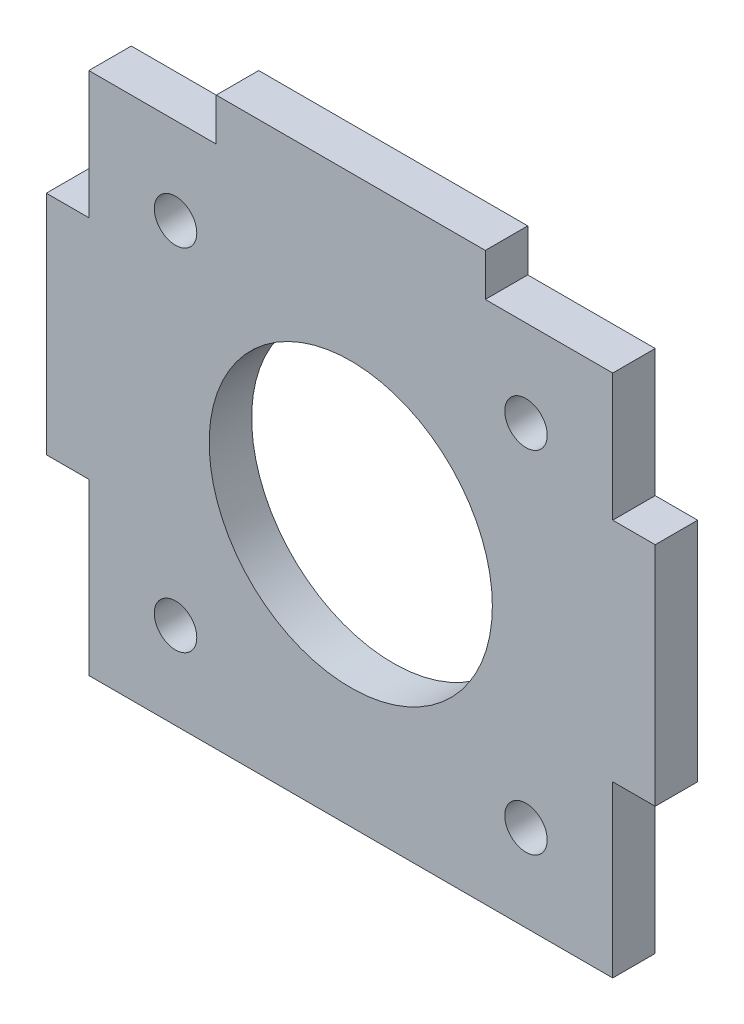
ISO-10303-21;
HEADER;
FILE_DESCRIPTION(('STEP AP214'),'2;1');
FILE_NAME('part.step','',(''),(''),'','','');
FILE_SCHEMA(('AUTOMOTIVE_DESIGN { 1 0 10303 214 1 1 1 1 }'));
ENDSEC;
DATA;
#1=APPLICATION_CONTEXT('core data for automotive mechanical design processes');
#2=APPLICATION_PROTOCOL_DEFINITION('international standard','automotive_design',2000,#1);
#3=PRODUCT_CONTEXT('',#1,'mechanical');
#4=PRODUCT('Part','Part','',(#3));
#5=PRODUCT_RELATED_PRODUCT_CATEGORY('part','',(#4));
#6=PRODUCT_DEFINITION_FORMATION('','',#4);
#7=PRODUCT_DEFINITION_CONTEXT('part definition',#1,'design');
#8=PRODUCT_DEFINITION('design','',#6,#7);
#9=PRODUCT_DEFINITION_SHAPE('','',#8);
#10=(LENGTH_UNIT() NAMED_UNIT(*) SI_UNIT(.MILLI.,.METRE.));
#11=(NAMED_UNIT(*) PLANE_ANGLE_UNIT() SI_UNIT($,.RADIAN.));
#12=(NAMED_UNIT(*) SI_UNIT($,.STERADIAN.) SOLID_ANGLE_UNIT());
#13=UNCERTAINTY_MEASURE_WITH_UNIT(LENGTH_MEASURE(1.E-05),#10,'distance_accuracy_value','');
#14=(GEOMETRIC_REPRESENTATION_CONTEXT(3) GLOBAL_UNCERTAINTY_ASSIGNED_CONTEXT((#13)) GLOBAL_UNIT_ASSIGNED_CONTEXT((#10,
#11,#12)) REPRESENTATION_CONTEXT('',''));
#15=CARTESIAN_POINT('',(0.,0.,0.));
#16=DIRECTION('',(0.,0.,1.));
#17=DIRECTION('',(1.,0.,0.));
#18=AXIS2_PLACEMENT_3D('',#15,#16,#17);
#19=CARTESIAN_POINT('',(0.,0.,3.));
#20=DIRECTION('',(0.,0.,1.));
#21=DIRECTION('',(1.,0.,0.));
#22=AXIS2_PLACEMENT_3D('',#19,#20,#21);
#23=PLANE('',#22);
#24=DIRECTION('',(-1.,0.,0.));
#25=VECTOR('',#24,1.);
#26=CARTESIAN_POINT('',(-21.5,-6.5,3.));
#27=LINE('',#26,#25);
#28=CARTESIAN_POINT('',(-18.5,-6.5,3.));
#29=VERTEX_POINT('',#28);
#30=CARTESIAN_POINT('',(-21.5,-6.5,3.));
#31=VERTEX_POINT('',#30);
#32=EDGE_CURVE('E62',#29,#31,#27,.T.);
#33=ORIENTED_EDGE('',*,*,#32,.F.);
#34=DIRECTION('',(0.,1.,0.));
#35=VECTOR('',#34,1.);
#36=CARTESIAN_POINT('',(-18.5,-18.5,3.));
#37=LINE('',#36,#35);
#38=CARTESIAN_POINT('',(-18.5,-18.5,3.));
#39=VERTEX_POINT('',#38);
#40=EDGE_CURVE('E290',#39,#29,#37,.T.);
#41=ORIENTED_EDGE('',*,*,#40,.F.);
#42=DIRECTION('',(-1.,0.,0.));
#43=VECTOR('',#42,1.);
#44=CARTESIAN_POINT('',(-18.5,-18.5,3.));
#45=LINE('',#44,#43);
#46=CARTESIAN_POINT('',(18.5,-18.5,3.));
#47=VERTEX_POINT('',#46);
#48=EDGE_CURVE('E293',#47,#39,#45,.T.);
#49=ORIENTED_EDGE('',*,*,#48,.F.);
#50=DIRECTION('',(0.,-1.,0.));
#51=VECTOR('',#50,1.);
#52=CARTESIAN_POINT('',(18.5,-18.5,3.));
#53=LINE('',#52,#51);
#54=CARTESIAN_POINT('',(18.5,-6.5,3.));
#55=VERTEX_POINT('',#54);
#56=EDGE_CURVE('E296',#55,#47,#53,.T.);
#57=ORIENTED_EDGE('',*,*,#56,.F.);
#58=DIRECTION('',(-1.,0.,0.));
#59=VECTOR('',#58,1.);
#60=CARTESIAN_POINT('',(21.5,-6.5,3.));
#61=LINE('',#60,#59);
#62=CARTESIAN_POINT('',(21.5,-6.5,3.));
#63=VERTEX_POINT('',#62);
#64=EDGE_CURVE('E259',#63,#55,#61,.T.);
#65=ORIENTED_EDGE('',*,*,#64,.F.);
#66=DIRECTION('',(0.,1.,0.));
#67=VECTOR('',#66,1.);
#68=CARTESIAN_POINT('',(21.5,21.5,3.));
#69=LINE('',#68,#67);
#70=CARTESIAN_POINT('',(21.5,9.5,3.));
#71=VERTEX_POINT('',#70);
#72=EDGE_CURVE('E170',#63,#71,#69,.T.);
#73=ORIENTED_EDGE('',*,*,#72,.T.);
#74=DIRECTION('',(1.,0.,0.));
#75=VECTOR('',#74,1.);
#76=CARTESIAN_POINT('',(21.5,9.5,3.));
#77=LINE('',#76,#75);
#78=CARTESIAN_POINT('',(18.5,9.5,3.));
#79=VERTEX_POINT('',#78);
#80=EDGE_CURVE('E239',#79,#71,#77,.T.);
#81=ORIENTED_EDGE('',*,*,#80,.F.);
#82=DIRECTION('',(0.,-1.,0.));
#83=VECTOR('',#82,1.);
#84=CARTESIAN_POINT('',(18.5,9.5,3.));
#85=LINE('',#84,#83);
#86=CARTESIAN_POINT('',(18.5,18.5,3.));
#87=VERTEX_POINT('',#86);
#88=EDGE_CURVE('E230',#87,#79,#85,.T.);
#89=ORIENTED_EDGE('',*,*,#88,.F.);
#90=DIRECTION('',(1.,0.,0.));
#91=VECTOR('',#90,1.);
#92=CARTESIAN_POINT('',(18.5,18.5,3.));
#93=LINE('',#92,#91);
#94=CARTESIAN_POINT('',(9.49999999999999,18.5,3.));
#95=VERTEX_POINT('',#94);
#96=EDGE_CURVE('E233',#95,#87,#93,.T.);
#97=ORIENTED_EDGE('',*,*,#96,.F.);
#98=DIRECTION('',(0.,-1.,0.));
#99=VECTOR('',#98,1.);
#100=CARTESIAN_POINT('',(9.49999999999999,18.5,3.));
#101=LINE('',#100,#99);
#102=CARTESIAN_POINT('',(9.49999999999999,21.5,3.));
#103=VERTEX_POINT('',#102);
#104=EDGE_CURVE('E236',#103,#95,#101,.T.);
#105=ORIENTED_EDGE('',*,*,#104,.F.);
#106=DIRECTION('',(-1.,0.,0.));
#107=VECTOR('',#106,1.);
#108=CARTESIAN_POINT('',(-21.5,21.5,3.));
#109=LINE('',#108,#107);
#110=CARTESIAN_POINT('',(-9.5,21.5,3.));
#111=VERTEX_POINT('',#110);
#112=EDGE_CURVE('E46',#103,#111,#109,.T.);
#113=ORIENTED_EDGE('',*,*,#112,.T.);
#114=DIRECTION('',(0.,1.,0.));
#115=VECTOR('',#114,1.);
#116=CARTESIAN_POINT('',(-9.5,18.5,3.));
#117=LINE('',#116,#115);
#118=CARTESIAN_POINT('',(-9.5,18.5,3.));
#119=VERTEX_POINT('',#118);
#120=EDGE_CURVE('E260',#119,#111,#117,.T.);
#121=ORIENTED_EDGE('',*,*,#120,.F.);
#122=DIRECTION('',(1.,0.,0.));
#123=VECTOR('',#122,1.);
#124=CARTESIAN_POINT('',(-18.5,18.5,3.));
#125=LINE('',#124,#123);
#126=CARTESIAN_POINT('',(-18.5,18.5,3.));
#127=VERTEX_POINT('',#126);
#128=EDGE_CURVE('E263',#127,#119,#125,.T.);
#129=ORIENTED_EDGE('',*,*,#128,.F.);
#130=DIRECTION('',(0.,1.,0.));
#131=VECTOR('',#130,1.);
#132=CARTESIAN_POINT('',(-18.5,9.49999999999999,3.));
#133=LINE('',#132,#131);
#134=CARTESIAN_POINT('',(-18.5,9.49999999999999,3.));
#135=VERTEX_POINT('',#134);
#136=EDGE_CURVE('E266',#135,#127,#133,.T.);
#137=ORIENTED_EDGE('',*,*,#136,.F.);
#138=DIRECTION('',(1.,0.,0.));
#139=VECTOR('',#138,1.);
#140=CARTESIAN_POINT('',(-21.5,9.49999999999999,3.));
#141=LINE('',#140,#139);
#142=CARTESIAN_POINT('',(-21.5,9.49999999999999,3.));
#143=VERTEX_POINT('',#142);
#144=EDGE_CURVE('E229',#143,#135,#141,.T.);
#145=ORIENTED_EDGE('',*,*,#144,.F.);
#146=DIRECTION('',(0.,-1.,0.));
#147=VECTOR('',#146,1.);
#148=CARTESIAN_POINT('',(-21.5,21.5,3.));
#149=LINE('',#148,#147);
#150=EDGE_CURVE('E11',#143,#31,#149,.T.);
#151=ORIENTED_EDGE('',*,*,#150,.T.);
#152=EDGE_LOOP('',(#33,#41,#49,#57,#65,#73,#81,#89,#97,#105,#113,#121,#129,#137,#145,#151));
#153=FACE_BOUND('',#152,.T.);
#154=CARTESIAN_POINT('',(-12.3743686707647,-12.3743686707645,3.));
#155=DIRECTION('',(0.,0.,1.));
#156=DIRECTION('',(1.,0.,0.));
#157=AXIS2_PLACEMENT_3D('',#154,#155,#156);
#158=CIRCLE('',#157,1.5);
#159=CARTESIAN_POINT('',(-10.8743686707647,-12.3743686707645,3.));
#160=VERTEX_POINT('',#159);
#161=EDGE_CURVE('E203',#160,#160,#158,.T.);
#162=ORIENTED_EDGE('',*,*,#161,.F.);
#163=EDGE_LOOP('',(#162));
#164=FACE_BOUND('',#163,.T.);
#165=CARTESIAN_POINT('',(12.3743686707645,-12.3743686707646,3.));
#166=DIRECTION('',(0.,0.,1.));
#167=DIRECTION('',(1.,0.,0.));
#168=AXIS2_PLACEMENT_3D('',#165,#166,#167);
#169=CIRCLE('',#168,1.5);
#170=CARTESIAN_POINT('',(13.8743686707645,-12.3743686707646,3.));
#171=VERTEX_POINT('',#170);
#172=EDGE_CURVE('E192',#171,#171,#169,.T.);
#173=ORIENTED_EDGE('',*,*,#172,.F.);
#174=EDGE_LOOP('',(#173));
#175=FACE_BOUND('',#174,.T.);
#176=CARTESIAN_POINT('',(-12.3743686707645,12.3743686707647,3.));
#177=DIRECTION('',(0.,0.,1.));
#178=DIRECTION('',(1.,0.,0.));
#179=AXIS2_PLACEMENT_3D('',#176,#177,#178);
#180=CIRCLE('',#179,1.5);
#181=CARTESIAN_POINT('',(-10.8743686707645,12.3743686707647,3.));
#182=VERTEX_POINT('',#181);
#183=EDGE_CURVE('E181',#182,#182,#180,.T.);
#184=ORIENTED_EDGE('',*,*,#183,.F.);
#185=EDGE_LOOP('',(#184));
#186=FACE_BOUND('',#185,.T.);
#187=CARTESIAN_POINT('',(12.3743686707646,12.3743686707645,3.));
#188=DIRECTION('',(0.,0.,1.));
#189=DIRECTION('',(1.,0.,0.));
#190=AXIS2_PLACEMENT_3D('',#187,#188,#189);
#191=CIRCLE('',#190,1.5);
#192=CARTESIAN_POINT('',(13.8743686707646,12.3743686707645,3.));
#193=VERTEX_POINT('',#192);
#194=EDGE_CURVE('E197',#193,#193,#191,.T.);
#195=ORIENTED_EDGE('',*,*,#194,.F.);
#196=EDGE_LOOP('',(#195));
#197=FACE_BOUND('',#196,.T.);
#198=CARTESIAN_POINT('',(0.,0.,3.));
#199=DIRECTION('',(0.,0.,1.));
#200=DIRECTION('',(1.,0.,0.));
#201=AXIS2_PLACEMENT_3D('',#198,#199,#200);
#202=CIRCLE('',#201,10.);
#203=CARTESIAN_POINT('',(9.99999999999999,0.,3.));
#204=VERTEX_POINT('',#203);
#205=EDGE_CURVE('E209',#204,#204,#202,.T.);
#206=ORIENTED_EDGE('',*,*,#205,.F.);
#207=EDGE_LOOP('',(#206));
#208=FACE_BOUND('',#207,.T.);
#209=ADVANCED_FACE('F37',(#153,#164,#175,#186,#197,#208),#23,.T.);
#210=CARTESIAN_POINT('',(0.,0.,0.));
#211=DIRECTION('',(0.,0.,1.));
#212=DIRECTION('',(1.,0.,0.));
#213=AXIS2_PLACEMENT_3D('',#210,#211,#212);
#214=PLANE('',#213);
#215=DIRECTION('',(0.,1.,0.));
#216=VECTOR('',#215,1.);
#217=CARTESIAN_POINT('',(-18.5,-18.5,0.));
#218=LINE('',#217,#216);
#219=CARTESIAN_POINT('',(-18.5,-18.5,0.));
#220=VERTEX_POINT('',#219);
#221=CARTESIAN_POINT('',(-18.5,-6.5,0.));
#222=VERTEX_POINT('',#221);
#223=EDGE_CURVE('E302',#220,#222,#218,.T.);
#224=ORIENTED_EDGE('',*,*,#223,.T.);
#225=DIRECTION('',(-1.,0.,0.));
#226=VECTOR('',#225,1.);
#227=CARTESIAN_POINT('',(-21.5,-6.5,0.));
#228=LINE('',#227,#226);
#229=CARTESIAN_POINT('',(-21.5,-6.5,0.));
#230=VERTEX_POINT('',#229);
#231=EDGE_CURVE('E171',#222,#230,#228,.T.);
#232=ORIENTED_EDGE('',*,*,#231,.T.);
#233=DIRECTION('',(0.,-1.,0.));
#234=VECTOR('',#233,1.);
#235=CARTESIAN_POINT('',(-21.5,21.5,0.));
#236=LINE('',#235,#234);
#237=CARTESIAN_POINT('',(-21.5,9.49999999999999,0.));
#238=VERTEX_POINT('',#237);
#239=EDGE_CURVE('E41',#238,#230,#236,.T.);
#240=ORIENTED_EDGE('',*,*,#239,.F.);
#241=DIRECTION('',(1.,0.,0.));
#242=VECTOR('',#241,1.);
#243=CARTESIAN_POINT('',(-21.5,9.49999999999999,0.));
#244=LINE('',#243,#242);
#245=CARTESIAN_POINT('',(-18.5,9.49999999999999,0.));
#246=VERTEX_POINT('',#245);
#247=EDGE_CURVE('E262',#238,#246,#244,.T.);
#248=ORIENTED_EDGE('',*,*,#247,.T.);
#249=DIRECTION('',(0.,1.,0.));
#250=VECTOR('',#249,1.);
#251=CARTESIAN_POINT('',(-18.5,9.49999999999999,0.));
#252=LINE('',#251,#250);
#253=CARTESIAN_POINT('',(-18.5,18.5,0.));
#254=VERTEX_POINT('',#253);
#255=EDGE_CURVE('E276',#246,#254,#252,.T.);
#256=ORIENTED_EDGE('',*,*,#255,.T.);
#257=DIRECTION('',(1.,0.,0.));
#258=VECTOR('',#257,1.);
#259=CARTESIAN_POINT('',(-18.5,18.5,0.));
#260=LINE('',#259,#258);
#261=CARTESIAN_POINT('',(-9.5,18.5,0.));
#262=VERTEX_POINT('',#261);
#263=EDGE_CURVE('E273',#254,#262,#260,.T.);
#264=ORIENTED_EDGE('',*,*,#263,.T.);
#265=DIRECTION('',(0.,1.,0.));
#266=VECTOR('',#265,1.);
#267=CARTESIAN_POINT('',(-9.5,18.5,0.));
#268=LINE('',#267,#266);
#269=CARTESIAN_POINT('',(-9.5,21.5,0.));
#270=VERTEX_POINT('',#269);
#271=EDGE_CURVE('E250',#262,#270,#268,.T.);
#272=ORIENTED_EDGE('',*,*,#271,.T.);
#273=DIRECTION('',(-1.,0.,0.));
#274=VECTOR('',#273,1.);
#275=CARTESIAN_POINT('',(-21.5,21.5,0.));
#276=LINE('',#275,#274);
#277=CARTESIAN_POINT('',(9.49999999999999,21.5,0.));
#278=VERTEX_POINT('',#277);
#279=EDGE_CURVE('E180',#278,#270,#276,.T.);
#280=ORIENTED_EDGE('',*,*,#279,.F.);
#281=DIRECTION('',(0.,-1.,0.));
#282=VECTOR('',#281,1.);
#283=CARTESIAN_POINT('',(9.49999999999999,18.5,0.));
#284=LINE('',#283,#282);
#285=CARTESIAN_POINT('',(9.49999999999999,18.5,0.));
#286=VERTEX_POINT('',#285);
#287=EDGE_CURVE('E54',#278,#286,#284,.T.);
#288=ORIENTED_EDGE('',*,*,#287,.T.);
#289=DIRECTION('',(1.,0.,0.));
#290=VECTOR('',#289,1.);
#291=CARTESIAN_POINT('',(18.5,18.5,0.));
#292=LINE('',#291,#290);
#293=CARTESIAN_POINT('',(18.5,18.5,0.));
#294=VERTEX_POINT('',#293);
#295=EDGE_CURVE('E242',#286,#294,#292,.T.);
#296=ORIENTED_EDGE('',*,*,#295,.T.);
#297=DIRECTION('',(0.,-1.,0.));
#298=VECTOR('',#297,1.);
#299=CARTESIAN_POINT('',(18.5,9.5,0.));
#300=LINE('',#299,#298);
#301=CARTESIAN_POINT('',(18.5,9.5,0.));
#302=VERTEX_POINT('',#301);
#303=EDGE_CURVE('E221',#294,#302,#300,.T.);
#304=ORIENTED_EDGE('',*,*,#303,.T.);
#305=DIRECTION('',(1.,0.,0.));
#306=VECTOR('',#305,1.);
#307=CARTESIAN_POINT('',(21.5,9.5,0.));
#308=LINE('',#307,#306);
#309=CARTESIAN_POINT('',(21.5,9.5,0.));
#310=VERTEX_POINT('',#309);
#311=EDGE_CURVE('E179',#302,#310,#308,.T.);
#312=ORIENTED_EDGE('',*,*,#311,.T.);
#313=DIRECTION('',(0.,1.,0.));
#314=VECTOR('',#313,1.);
#315=CARTESIAN_POINT('',(21.5,21.5,0.));
#316=LINE('',#315,#314);
#317=CARTESIAN_POINT('',(21.5,-6.5,0.));
#318=VERTEX_POINT('',#317);
#319=EDGE_CURVE('E168',#318,#310,#316,.T.);
#320=ORIENTED_EDGE('',*,*,#319,.F.);
#321=DIRECTION('',(-1.,0.,0.));
#322=VECTOR('',#321,1.);
#323=CARTESIAN_POINT('',(21.5,-6.5,0.));
#324=LINE('',#323,#322);
#325=CARTESIAN_POINT('',(18.5,-6.5,0.));
#326=VERTEX_POINT('',#325);
#327=EDGE_CURVE('E151',#318,#326,#324,.T.);
#328=ORIENTED_EDGE('',*,*,#327,.T.);
#329=DIRECTION('',(0.,-1.,0.));
#330=VECTOR('',#329,1.);
#331=CARTESIAN_POINT('',(18.5,-18.5,0.));
#332=LINE('',#331,#330);
#333=CARTESIAN_POINT('',(18.5,-18.5,0.));
#334=VERTEX_POINT('',#333);
#335=EDGE_CURVE('E162',#326,#334,#332,.T.);
#336=ORIENTED_EDGE('',*,*,#335,.T.);
#337=DIRECTION('',(-1.,0.,0.));
#338=VECTOR('',#337,1.);
#339=CARTESIAN_POINT('',(-18.5,-18.5,0.));
#340=LINE('',#339,#338);
#341=EDGE_CURVE('E304',#334,#220,#340,.T.);
#342=ORIENTED_EDGE('',*,*,#341,.T.);
#343=EDGE_LOOP('',(#224,#232,#240,#248,#256,#264,#272,#280,#288,#296,#304,#312,#320,#328,#336,#342));
#344=FACE_BOUND('',#343,.T.);
#345=CARTESIAN_POINT('',(-12.3743686707645,12.3743686707647,0.));
#346=DIRECTION('',(0.,0.,1.));
#347=DIRECTION('',(1.,0.,0.));
#348=AXIS2_PLACEMENT_3D('',#345,#346,#347);
#349=CIRCLE('',#348,1.5);
#350=CARTESIAN_POINT('',(-10.8743686707645,12.3743686707647,0.));
#351=VERTEX_POINT('',#350);
#352=EDGE_CURVE('E185',#351,#351,#349,.T.);
#353=ORIENTED_EDGE('',*,*,#352,.T.);
#354=EDGE_LOOP('',(#353));
#355=FACE_BOUND('',#354,.T.);
#356=CARTESIAN_POINT('',(12.3743686707645,-12.3743686707646,0.));
#357=DIRECTION('',(0.,0.,1.));
#358=DIRECTION('',(1.,0.,0.));
#359=AXIS2_PLACEMENT_3D('',#356,#357,#358);
#360=CIRCLE('',#359,1.5);
#361=CARTESIAN_POINT('',(13.8743686707645,-12.3743686707646,0.));
#362=VERTEX_POINT('',#361);
#363=EDGE_CURVE('E194',#362,#362,#360,.T.);
#364=ORIENTED_EDGE('',*,*,#363,.T.);
#365=EDGE_LOOP('',(#364));
#366=FACE_BOUND('',#365,.T.);
#367=CARTESIAN_POINT('',(12.3743686707646,12.3743686707645,0.));
#368=DIRECTION('',(0.,0.,1.));
#369=DIRECTION('',(1.,0.,0.));
#370=AXIS2_PLACEMENT_3D('',#367,#368,#369);
#371=CIRCLE('',#370,1.5);
#372=CARTESIAN_POINT('',(13.8743686707646,12.3743686707645,0.));
#373=VERTEX_POINT('',#372);
#374=EDGE_CURVE('E200',#373,#373,#371,.T.);
#375=ORIENTED_EDGE('',*,*,#374,.T.);
#376=EDGE_LOOP('',(#375));
#377=FACE_BOUND('',#376,.T.);
#378=CARTESIAN_POINT('',(-12.3743686707647,-12.3743686707645,0.));
#379=DIRECTION('',(0.,0.,1.));
#380=DIRECTION('',(1.,0.,0.));
#381=AXIS2_PLACEMENT_3D('',#378,#379,#380);
#382=CIRCLE('',#381,1.5);
#383=CARTESIAN_POINT('',(-10.8743686707647,-12.3743686707645,0.));
#384=VERTEX_POINT('',#383);
#385=EDGE_CURVE('E206',#384,#384,#382,.T.);
#386=ORIENTED_EDGE('',*,*,#385,.T.);
#387=EDGE_LOOP('',(#386));
#388=FACE_BOUND('',#387,.T.);
#389=CARTESIAN_POINT('',(0.,0.,0.));
#390=DIRECTION('',(0.,0.,1.));
#391=DIRECTION('',(1.,0.,0.));
#392=AXIS2_PLACEMENT_3D('',#389,#390,#391);
#393=CIRCLE('',#392,10.);
#394=CARTESIAN_POINT('',(9.99999999999999,0.,0.));
#395=VERTEX_POINT('',#394);
#396=EDGE_CURVE('E212',#395,#395,#393,.T.);
#397=ORIENTED_EDGE('',*,*,#396,.T.);
#398=EDGE_LOOP('',(#397));
#399=FACE_BOUND('',#398,.T.);
#400=ADVANCED_FACE('F175',(#344,#355,#366,#377,#388,#399),#214,.F.);
#401=CARTESIAN_POINT('',(21.5,21.5,3.));
#402=DIRECTION('',(-1.,0.,0.));
#403=DIRECTION('',(0.,-1.,0.));
#404=AXIS2_PLACEMENT_3D('',#401,#402,#403);
#405=PLANE('',#404);
#406=ORIENTED_EDGE('',*,*,#72,.F.);
#407=DIRECTION('',(0.,0.,1.));
#408=VECTOR('',#407,1.);
#409=CARTESIAN_POINT('',(21.5,-6.5,0.));
#410=LINE('',#409,#408);
#411=EDGE_CURVE('E155',#318,#63,#410,.T.);
#412=ORIENTED_EDGE('',*,*,#411,.F.);
#413=ORIENTED_EDGE('',*,*,#319,.T.);
#414=DIRECTION('',(0.,0.,1.));
#415=VECTOR('',#414,1.);
#416=CARTESIAN_POINT('',(21.5,9.5,0.));
#417=LINE('',#416,#415);
#418=EDGE_CURVE('E218',#310,#71,#417,.T.);
#419=ORIENTED_EDGE('',*,*,#418,.T.);
#420=EDGE_LOOP('',(#406,#412,#413,#419));
#421=FACE_BOUND('',#420,.T.);
#422=ADVANCED_FACE('F39',(#421),#405,.F.);
#423=CARTESIAN_POINT('',(-21.5,21.5,3.));
#424=DIRECTION('',(0.,-1.,0.));
#425=DIRECTION('',(1.,0.,0.));
#426=AXIS2_PLACEMENT_3D('',#423,#424,#425);
#427=PLANE('',#426);
#428=ORIENTED_EDGE('',*,*,#279,.T.);
#429=DIRECTION('',(0.,0.,1.));
#430=VECTOR('',#429,1.);
#431=CARTESIAN_POINT('',(-9.5,21.5,0.));
#432=LINE('',#431,#430);
#433=EDGE_CURVE('E256',#270,#111,#432,.T.);
#434=ORIENTED_EDGE('',*,*,#433,.T.);
#435=ORIENTED_EDGE('',*,*,#112,.F.);
#436=DIRECTION('',(0.,0.,1.));
#437=VECTOR('',#436,1.);
#438=CARTESIAN_POINT('',(9.49999999999999,21.5,0.));
#439=LINE('',#438,#437);
#440=EDGE_CURVE('E220',#278,#103,#439,.T.);
#441=ORIENTED_EDGE('',*,*,#440,.F.);
#442=EDGE_LOOP('',(#428,#434,#435,#441));
#443=FACE_BOUND('',#442,.T.);
#444=ADVANCED_FACE('F345',(#443),#427,.F.);
#445=CARTESIAN_POINT('',(-21.5,21.5,3.));
#446=DIRECTION('',(1.,0.,0.));
#447=DIRECTION('',(0.,1.,0.));
#448=AXIS2_PLACEMENT_3D('',#445,#446,#447);
#449=PLANE('',#448);
#450=ORIENTED_EDGE('',*,*,#239,.T.);
#451=DIRECTION('',(0.,0.,1.));
#452=VECTOR('',#451,1.);
#453=CARTESIAN_POINT('',(-21.5,-6.5,0.));
#454=LINE('',#453,#452);
#455=EDGE_CURVE('E215',#230,#31,#454,.T.);
#456=ORIENTED_EDGE('',*,*,#455,.T.);
#457=ORIENTED_EDGE('',*,*,#150,.F.);
#458=DIRECTION('',(0.,0.,1.));
#459=VECTOR('',#458,1.);
#460=CARTESIAN_POINT('',(-21.5,9.49999999999999,0.));
#461=LINE('',#460,#459);
#462=EDGE_CURVE('E247',#238,#143,#461,.T.);
#463=ORIENTED_EDGE('',*,*,#462,.F.);
#464=EDGE_LOOP('',(#450,#456,#457,#463));
#465=FACE_BOUND('',#464,.T.);
#466=ADVANCED_FACE('F323',(#465),#449,.F.);
#467=CARTESIAN_POINT('',(-12.3743686707645,12.3743686707647,3.));
#468=DIRECTION('',(0.,0.,-1.));
#469=DIRECTION('',(-1.,0.,0.));
#470=AXIS2_PLACEMENT_3D('',#467,#468,#469);
#471=CYLINDRICAL_SURFACE('',#470,1.5);
#472=ORIENTED_EDGE('',*,*,#183,.T.);
#473=EDGE_LOOP('',(#472));
#474=FACE_BOUND('',#473,.T.);
#475=ORIENTED_EDGE('',*,*,#352,.F.);
#476=EDGE_LOOP('',(#475));
#477=FACE_BOUND('',#476,.T.);
#478=ADVANCED_FACE('F376',(#474,#477),#471,.F.);
#479=CARTESIAN_POINT('',(12.3743686707645,-12.3743686707646,3.));
#480=DIRECTION('',(0.,0.,-1.));
#481=DIRECTION('',(-1.,0.,0.));
#482=AXIS2_PLACEMENT_3D('',#479,#480,#481);
#483=CYLINDRICAL_SURFACE('',#482,1.5);
#484=ORIENTED_EDGE('',*,*,#172,.T.);
#485=EDGE_LOOP('',(#484));
#486=FACE_BOUND('',#485,.T.);
#487=ORIENTED_EDGE('',*,*,#363,.F.);
#488=EDGE_LOOP('',(#487));
#489=FACE_BOUND('',#488,.T.);
#490=ADVANCED_FACE('F429',(#486,#489),#483,.F.);
#491=CARTESIAN_POINT('',(12.3743686707646,12.3743686707645,3.));
#492=DIRECTION('',(0.,0.,-1.));
#493=DIRECTION('',(-1.,0.,0.));
#494=AXIS2_PLACEMENT_3D('',#491,#492,#493);
#495=CYLINDRICAL_SURFACE('',#494,1.5);
#496=ORIENTED_EDGE('',*,*,#194,.T.);
#497=EDGE_LOOP('',(#496));
#498=FACE_BOUND('',#497,.T.);
#499=ORIENTED_EDGE('',*,*,#374,.F.);
#500=EDGE_LOOP('',(#499));
#501=FACE_BOUND('',#500,.T.);
#502=ADVANCED_FACE('F418',(#498,#501),#495,.F.);
#503=CARTESIAN_POINT('',(-12.3743686707647,-12.3743686707645,3.));
#504=DIRECTION('',(0.,0.,-1.));
#505=DIRECTION('',(-1.,0.,0.));
#506=AXIS2_PLACEMENT_3D('',#503,#504,#505);
#507=CYLINDRICAL_SURFACE('',#506,1.5);
#508=ORIENTED_EDGE('',*,*,#161,.T.);
#509=EDGE_LOOP('',(#508));
#510=FACE_BOUND('',#509,.T.);
#511=ORIENTED_EDGE('',*,*,#385,.F.);
#512=EDGE_LOOP('',(#511));
#513=FACE_BOUND('',#512,.T.);
#514=ADVANCED_FACE('F406',(#510,#513),#507,.F.);
#515=CARTESIAN_POINT('',(0.,0.,3.));
#516=DIRECTION('',(0.,0.,-1.));
#517=DIRECTION('',(-1.,0.,0.));
#518=AXIS2_PLACEMENT_3D('',#515,#516,#517);
#519=CYLINDRICAL_SURFACE('',#518,10.);
#520=ORIENTED_EDGE('',*,*,#205,.T.);
#521=EDGE_LOOP('',(#520));
#522=FACE_BOUND('',#521,.T.);
#523=ORIENTED_EDGE('',*,*,#396,.F.);
#524=EDGE_LOOP('',(#523));
#525=FACE_BOUND('',#524,.T.);
#526=ADVANCED_FACE('F401',(#522,#525),#519,.F.);
#527=CARTESIAN_POINT('',(-9.5,18.5,0.));
#528=DIRECTION('',(1.,0.,0.));
#529=DIRECTION('',(0.,0.,-1.));
#530=AXIS2_PLACEMENT_3D('',#527,#528,#529);
#531=PLANE('',#530);
#532=ORIENTED_EDGE('',*,*,#120,.T.);
#533=ORIENTED_EDGE('',*,*,#433,.F.);
#534=ORIENTED_EDGE('',*,*,#271,.F.);
#535=DIRECTION('',(0.,0.,1.));
#536=VECTOR('',#535,1.);
#537=CARTESIAN_POINT('',(-9.5,18.5,0.));
#538=LINE('',#537,#536);
#539=EDGE_CURVE('E254',#262,#119,#538,.T.);
#540=ORIENTED_EDGE('',*,*,#539,.T.);
#541=EDGE_LOOP('',(#532,#533,#534,#540));
#542=FACE_BOUND('',#541,.T.);
#543=ADVANCED_FACE('F342',(#542),#531,.F.);
#544=CARTESIAN_POINT('',(-18.5,18.5,0.));
#545=DIRECTION('',(0.,-1.,0.));
#546=DIRECTION('',(0.,0.,-1.));
#547=AXIS2_PLACEMENT_3D('',#544,#545,#546);
#548=PLANE('',#547);
#549=ORIENTED_EDGE('',*,*,#128,.T.);
#550=ORIENTED_EDGE('',*,*,#539,.F.);
#551=ORIENTED_EDGE('',*,*,#263,.F.);
#552=DIRECTION('',(0.,0.,1.));
#553=VECTOR('',#552,1.);
#554=CARTESIAN_POINT('',(-18.5,18.5,0.));
#555=LINE('',#554,#553);
#556=EDGE_CURVE('E252',#254,#127,#555,.T.);
#557=ORIENTED_EDGE('',*,*,#556,.T.);
#558=EDGE_LOOP('',(#549,#550,#551,#557));
#559=FACE_BOUND('',#558,.T.);
#560=ADVANCED_FACE('F340',(#559),#548,.F.);
#561=CARTESIAN_POINT('',(-18.5,9.49999999999999,0.));
#562=DIRECTION('',(1.,0.,0.));
#563=DIRECTION('',(0.,0.,-1.));
#564=AXIS2_PLACEMENT_3D('',#561,#562,#563);
#565=PLANE('',#564);
#566=ORIENTED_EDGE('',*,*,#136,.T.);
#567=ORIENTED_EDGE('',*,*,#556,.F.);
#568=ORIENTED_EDGE('',*,*,#255,.F.);
#569=DIRECTION('',(0.,0.,1.));
#570=VECTOR('',#569,1.);
#571=CARTESIAN_POINT('',(-18.5,9.49999999999999,0.));
#572=LINE('',#571,#570);
#573=EDGE_CURVE('E249',#246,#135,#572,.T.);
#574=ORIENTED_EDGE('',*,*,#573,.T.);
#575=EDGE_LOOP('',(#566,#567,#568,#574));
#576=FACE_BOUND('',#575,.T.);
#577=ADVANCED_FACE('F334',(#576),#565,.F.);
#578=CARTESIAN_POINT('',(-21.5,9.49999999999999,0.));
#579=DIRECTION('',(0.,-1.,0.));
#580=DIRECTION('',(0.,0.,-1.));
#581=AXIS2_PLACEMENT_3D('',#578,#579,#580);
#582=PLANE('',#581);
#583=ORIENTED_EDGE('',*,*,#144,.T.);
#584=ORIENTED_EDGE('',*,*,#573,.F.);
#585=ORIENTED_EDGE('',*,*,#247,.F.);
#586=ORIENTED_EDGE('',*,*,#462,.T.);
#587=EDGE_LOOP('',(#583,#584,#585,#586));
#588=FACE_BOUND('',#587,.T.);
#589=ADVANCED_FACE('F327',(#588),#582,.F.);
#590=CARTESIAN_POINT('',(-21.5,-6.5,0.));
#591=DIRECTION('',(0.,1.,0.));
#592=DIRECTION('',(0.,0.,1.));
#593=AXIS2_PLACEMENT_3D('',#590,#591,#592);
#594=PLANE('',#593);
#595=ORIENTED_EDGE('',*,*,#32,.T.);
#596=ORIENTED_EDGE('',*,*,#455,.F.);
#597=ORIENTED_EDGE('',*,*,#231,.F.);
#598=DIRECTION('',(0.,0.,1.));
#599=VECTOR('',#598,1.);
#600=CARTESIAN_POINT('',(-18.5,-6.5,0.));
#601=LINE('',#600,#599);
#602=EDGE_CURVE('E286',#222,#29,#601,.T.);
#603=ORIENTED_EDGE('',*,*,#602,.T.);
#604=EDGE_LOOP('',(#595,#596,#597,#603));
#605=FACE_BOUND('',#604,.T.);
#606=ADVANCED_FACE('F492',(#605),#594,.F.);
#607=CARTESIAN_POINT('',(-18.5,-18.5,0.));
#608=DIRECTION('',(1.,0.,0.));
#609=DIRECTION('',(0.,0.,-1.));
#610=AXIS2_PLACEMENT_3D('',#607,#608,#609);
#611=PLANE('',#610);
#612=ORIENTED_EDGE('',*,*,#40,.T.);
#613=ORIENTED_EDGE('',*,*,#602,.F.);
#614=ORIENTED_EDGE('',*,*,#223,.F.);
#615=DIRECTION('',(0.,0.,1.));
#616=VECTOR('',#615,1.);
#617=CARTESIAN_POINT('',(-18.5,-18.5,0.));
#618=LINE('',#617,#616);
#619=EDGE_CURVE('E284',#220,#39,#618,.T.);
#620=ORIENTED_EDGE('',*,*,#619,.T.);
#621=EDGE_LOOP('',(#612,#613,#614,#620));
#622=FACE_BOUND('',#621,.T.);
#623=ADVANCED_FACE('F317',(#622),#611,.F.);
#624=CARTESIAN_POINT('',(-18.5,-18.5,0.));
#625=DIRECTION('',(0.,1.,0.));
#626=DIRECTION('',(0.,0.,1.));
#627=AXIS2_PLACEMENT_3D('',#624,#625,#626);
#628=PLANE('',#627);
#629=ORIENTED_EDGE('',*,*,#48,.T.);
#630=ORIENTED_EDGE('',*,*,#619,.F.);
#631=ORIENTED_EDGE('',*,*,#341,.F.);
#632=DIRECTION('',(0.,0.,1.));
#633=VECTOR('',#632,1.);
#634=CARTESIAN_POINT('',(18.5,-18.5,0.));
#635=LINE('',#634,#633);
#636=EDGE_CURVE('E282',#334,#47,#635,.T.);
#637=ORIENTED_EDGE('',*,*,#636,.T.);
#638=EDGE_LOOP('',(#629,#630,#631,#637));
#639=FACE_BOUND('',#638,.T.);
#640=ADVANCED_FACE('F313',(#639),#628,.F.);
#641=CARTESIAN_POINT('',(18.5,-18.5,0.));
#642=DIRECTION('',(-1.,0.,0.));
#643=DIRECTION('',(0.,-1.,0.));
#644=AXIS2_PLACEMENT_3D('',#641,#642,#643);
#645=PLANE('',#644);
#646=ORIENTED_EDGE('',*,*,#56,.T.);
#647=ORIENTED_EDGE('',*,*,#636,.F.);
#648=ORIENTED_EDGE('',*,*,#335,.F.);
#649=DIRECTION('',(0.,0.,1.));
#650=VECTOR('',#649,1.);
#651=CARTESIAN_POINT('',(18.5,-6.5,0.));
#652=LINE('',#651,#650);
#653=EDGE_CURVE('E157',#326,#55,#652,.T.);
#654=ORIENTED_EDGE('',*,*,#653,.T.);
#655=EDGE_LOOP('',(#646,#647,#648,#654));
#656=FACE_BOUND('',#655,.T.);
#657=ADVANCED_FACE('F309',(#656),#645,.F.);
#658=CARTESIAN_POINT('',(21.5,-6.5,0.));
#659=DIRECTION('',(0.,1.,0.));
#660=DIRECTION('',(-1.,0.,0.));
#661=AXIS2_PLACEMENT_3D('',#658,#659,#660);
#662=PLANE('',#661);
#663=ORIENTED_EDGE('',*,*,#64,.T.);
#664=ORIENTED_EDGE('',*,*,#653,.F.);
#665=ORIENTED_EDGE('',*,*,#327,.F.);
#666=ORIENTED_EDGE('',*,*,#411,.T.);
#667=EDGE_LOOP('',(#663,#664,#665,#666));
#668=FACE_BOUND('',#667,.T.);
#669=ADVANCED_FACE('F154',(#668),#662,.F.);
#670=CARTESIAN_POINT('',(21.5,9.5,0.));
#671=DIRECTION('',(0.,-1.,0.));
#672=DIRECTION('',(0.,0.,-1.));
#673=AXIS2_PLACEMENT_3D('',#670,#671,#672);
#674=PLANE('',#673);
#675=ORIENTED_EDGE('',*,*,#80,.T.);
#676=ORIENTED_EDGE('',*,*,#418,.F.);
#677=ORIENTED_EDGE('',*,*,#311,.F.);
#678=DIRECTION('',(0.,0.,1.));
#679=VECTOR('',#678,1.);
#680=CARTESIAN_POINT('',(18.5,9.5,0.));
#681=LINE('',#680,#679);
#682=EDGE_CURVE('E227',#302,#79,#681,.T.);
#683=ORIENTED_EDGE('',*,*,#682,.T.);
#684=EDGE_LOOP('',(#675,#676,#677,#683));
#685=FACE_BOUND('',#684,.T.);
#686=ADVANCED_FACE('F358',(#685),#674,.F.);
#687=CARTESIAN_POINT('',(18.5,9.5,0.));
#688=DIRECTION('',(-1.,0.,0.));
#689=DIRECTION('',(0.,-1.,0.));
#690=AXIS2_PLACEMENT_3D('',#687,#688,#689);
#691=PLANE('',#690);
#692=ORIENTED_EDGE('',*,*,#88,.T.);
#693=ORIENTED_EDGE('',*,*,#682,.F.);
#694=ORIENTED_EDGE('',*,*,#303,.F.);
#695=DIRECTION('',(0.,0.,1.));
#696=VECTOR('',#695,1.);
#697=CARTESIAN_POINT('',(18.5,18.5,0.));
#698=LINE('',#697,#696);
#699=EDGE_CURVE('E225',#294,#87,#698,.T.);
#700=ORIENTED_EDGE('',*,*,#699,.T.);
#701=EDGE_LOOP('',(#692,#693,#694,#700));
#702=FACE_BOUND('',#701,.T.);
#703=ADVANCED_FACE('F355',(#702),#691,.F.);
#704=CARTESIAN_POINT('',(18.5,18.5,0.));
#705=DIRECTION('',(0.,-1.,0.));
#706=DIRECTION('',(0.,0.,-1.));
#707=AXIS2_PLACEMENT_3D('',#704,#705,#706);
#708=PLANE('',#707);
#709=ORIENTED_EDGE('',*,*,#96,.T.);
#710=ORIENTED_EDGE('',*,*,#699,.F.);
#711=ORIENTED_EDGE('',*,*,#295,.F.);
#712=DIRECTION('',(0.,0.,1.));
#713=VECTOR('',#712,1.);
#714=CARTESIAN_POINT('',(9.49999999999999,18.5,0.));
#715=LINE('',#714,#713);
#716=EDGE_CURVE('E223',#286,#95,#715,.T.);
#717=ORIENTED_EDGE('',*,*,#716,.T.);
#718=EDGE_LOOP('',(#709,#710,#711,#717));
#719=FACE_BOUND('',#718,.T.);
#720=ADVANCED_FACE('F353',(#719),#708,.F.);
#721=CARTESIAN_POINT('',(9.49999999999999,18.5,0.));
#722=DIRECTION('',(-1.,0.,0.));
#723=DIRECTION('',(0.,-1.,0.));
#724=AXIS2_PLACEMENT_3D('',#721,#722,#723);
#725=PLANE('',#724);
#726=ORIENTED_EDGE('',*,*,#104,.T.);
#727=ORIENTED_EDGE('',*,*,#716,.F.);
#728=ORIENTED_EDGE('',*,*,#287,.F.);
#729=ORIENTED_EDGE('',*,*,#440,.T.);
#730=EDGE_LOOP('',(#726,#727,#728,#729));
#731=FACE_BOUND('',#730,.T.);
#732=ADVANCED_FACE('F349',(#731),#725,.F.);
#733=CLOSED_SHELL('',(#209,#400,#422,#444,#466,#478,#490,#502,#514,#526,#543,#560,#577,#589,
#606,#623,#640,#657,#669,#686,#703,#720,#732));
#734=MANIFOLD_SOLID_BREP('B2',#733);
#735=ADVANCED_BREP_SHAPE_REPRESENTATION('',(#18,#734),#14);
#736=SHAPE_DEFINITION_REPRESENTATION(#9,#735);
ENDSEC;
END-ISO-10303-21;
